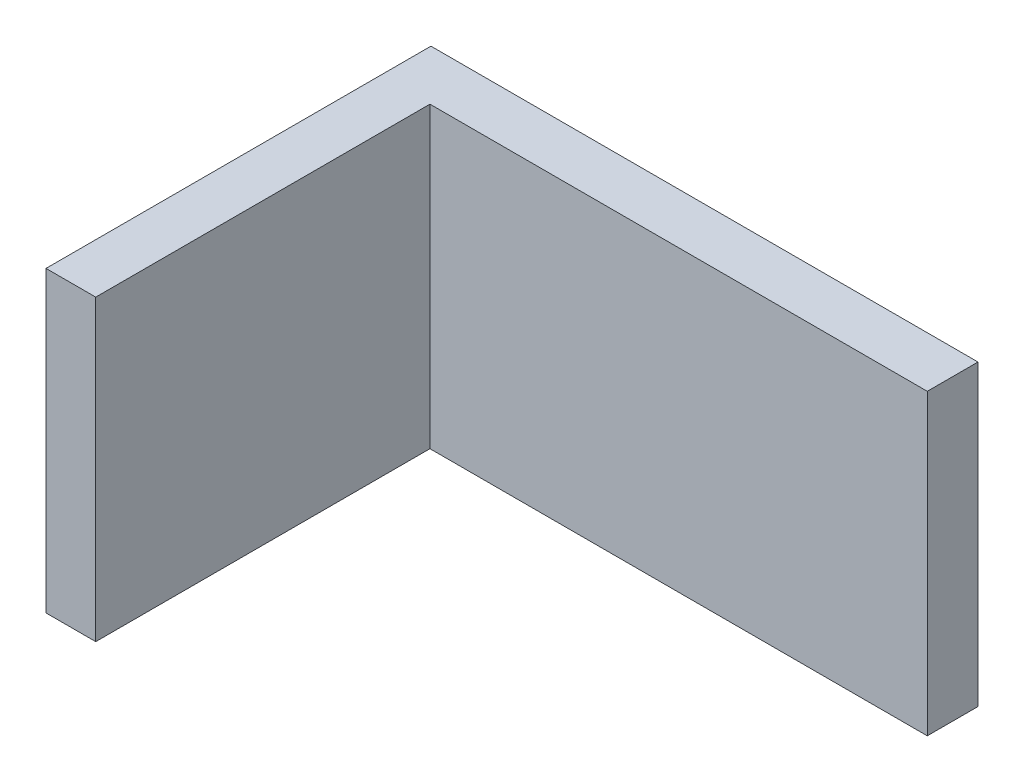
ISO-10303-21;
HEADER;
FILE_DESCRIPTION(('STEP AP214'),'2;1');
FILE_NAME('part.step','',(''),(''),'','','');
FILE_SCHEMA(('AUTOMOTIVE_DESIGN { 1 0 10303 214 1 1 1 1 }'));
ENDSEC;
DATA;
#1=APPLICATION_CONTEXT('core data for automotive mechanical design processes');
#2=APPLICATION_PROTOCOL_DEFINITION('international standard','automotive_design',2000,#1);
#3=PRODUCT_CONTEXT('',#1,'mechanical');
#4=PRODUCT('Part','Part','',(#3));
#5=PRODUCT_RELATED_PRODUCT_CATEGORY('part','',(#4));
#6=PRODUCT_DEFINITION_FORMATION('','',#4);
#7=PRODUCT_DEFINITION_CONTEXT('part definition',#1,'design');
#8=PRODUCT_DEFINITION('design','',#6,#7);
#9=PRODUCT_DEFINITION_SHAPE('','',#8);
#10=(LENGTH_UNIT() NAMED_UNIT(*) SI_UNIT(.MILLI.,.METRE.));
#11=(NAMED_UNIT(*) PLANE_ANGLE_UNIT() SI_UNIT($,.RADIAN.));
#12=(NAMED_UNIT(*) SI_UNIT($,.STERADIAN.) SOLID_ANGLE_UNIT());
#13=UNCERTAINTY_MEASURE_WITH_UNIT(LENGTH_MEASURE(1.E-05),#10,'distance_accuracy_value','');
#14=(GEOMETRIC_REPRESENTATION_CONTEXT(3) GLOBAL_UNCERTAINTY_ASSIGNED_CONTEXT((#13)) GLOBAL_UNIT_ASSIGNED_CONTEXT((#10,
#11,#12)) REPRESENTATION_CONTEXT('',''));
#15=CARTESIAN_POINT('',(0.,0.,0.));
#16=DIRECTION('',(0.,0.,1.));
#17=DIRECTION('',(1.,0.,0.));
#18=AXIS2_PLACEMENT_3D('',#15,#16,#17);
#19=CARTESIAN_POINT('',(-4.55,-0.4,0.));
#20=DIRECTION('',(0.,-1.,0.));
#21=DIRECTION('',(0.,0.,1.));
#22=AXIS2_PLACEMENT_3D('',#19,#20,#21);
#23=PLANE('',#22);
#24=DIRECTION('',(-1.,0.,0.));
#25=VECTOR('',#24,1.);
#26=CARTESIAN_POINT('',(-4.,-0.4,0.));
#27=LINE('',#26,#25);
#28=CARTESIAN_POINT('',(-4.,-0.4,0.));
#29=VERTEX_POINT('',#28);
#30=CARTESIAN_POINT('',(-4.55,-0.4,0.));
#31=VERTEX_POINT('',#30);
#32=EDGE_CURVE('E11',#29,#31,#27,.T.);
#33=ORIENTED_EDGE('',*,*,#32,.F.);
#34=DIRECTION('',(0.,0.,-1.));
#35=VECTOR('',#34,1.);
#36=CARTESIAN_POINT('',(-4.,-0.4,0.051));
#37=LINE('',#36,#35);
#38=CARTESIAN_POINT('',(-4.,-0.4,0.051));
#39=VERTEX_POINT('',#38);
#40=EDGE_CURVE('E24',#39,#29,#37,.T.);
#41=ORIENTED_EDGE('',*,*,#40,.F.);
#42=DIRECTION('',(1.,0.,0.));
#43=VECTOR('',#42,1.);
#44=CARTESIAN_POINT('',(-4.5,-0.4,0.051));
#45=LINE('',#44,#43);
#46=CARTESIAN_POINT('',(-4.5,-0.4,0.051));
#47=VERTEX_POINT('',#46);
#48=EDGE_CURVE('E87',#47,#39,#45,.T.);
#49=ORIENTED_EDGE('',*,*,#48,.F.);
#50=DIRECTION('',(0.,0.,-1.));
#51=VECTOR('',#50,1.);
#52=CARTESIAN_POINT('',(-4.5,-0.4,0.387));
#53=LINE('',#52,#51);
#54=CARTESIAN_POINT('',(-4.5,-0.4,0.387));
#55=VERTEX_POINT('',#54);
#56=EDGE_CURVE('E114',#55,#47,#53,.T.);
#57=ORIENTED_EDGE('',*,*,#56,.F.);
#58=DIRECTION('',(1.,0.,0.));
#59=VECTOR('',#58,1.);
#60=CARTESIAN_POINT('',(-4.55,-0.4,0.387));
#61=LINE('',#60,#59);
#62=CARTESIAN_POINT('',(-4.55,-0.4,0.387));
#63=VERTEX_POINT('',#62);
#64=EDGE_CURVE('E111',#63,#55,#61,.T.);
#65=ORIENTED_EDGE('',*,*,#64,.F.);
#66=DIRECTION('',(0.,0.,1.));
#67=VECTOR('',#66,1.);
#68=CARTESIAN_POINT('',(-4.55,-0.4,0.));
#69=LINE('',#68,#67);
#70=EDGE_CURVE('E108',#31,#63,#69,.T.);
#71=ORIENTED_EDGE('',*,*,#70,.F.);
#72=EDGE_LOOP('',(#33,#41,#49,#57,#65,#71));
#73=FACE_BOUND('',#72,.T.);
#74=ADVANCED_FACE('F17',(#73),#23,.T.);
#75=CARTESIAN_POINT('',(-4.,-0.1,0.));
#76=DIRECTION('',(0.,1.,0.));
#77=DIRECTION('',(0.,0.,1.));
#78=AXIS2_PLACEMENT_3D('',#75,#76,#77);
#79=PLANE('',#78);
#80=DIRECTION('',(1.,0.,0.));
#81=VECTOR('',#80,1.);
#82=CARTESIAN_POINT('',(-4.55,-0.1,0.));
#83=LINE('',#82,#81);
#84=CARTESIAN_POINT('',(-4.55,-0.1,0.));
#85=VERTEX_POINT('',#84);
#86=CARTESIAN_POINT('',(-4.,-0.1,0.));
#87=VERTEX_POINT('',#86);
#88=EDGE_CURVE('E106',#85,#87,#83,.T.);
#89=ORIENTED_EDGE('',*,*,#88,.F.);
#90=DIRECTION('',(0.,0.,-1.));
#91=VECTOR('',#90,1.);
#92=CARTESIAN_POINT('',(-4.55,-0.1,0.387));
#93=LINE('',#92,#91);
#94=CARTESIAN_POINT('',(-4.55,-0.1,0.387));
#95=VERTEX_POINT('',#94);
#96=EDGE_CURVE('E103',#95,#85,#93,.T.);
#97=ORIENTED_EDGE('',*,*,#96,.F.);
#98=DIRECTION('',(-1.,0.,0.));
#99=VECTOR('',#98,1.);
#100=CARTESIAN_POINT('',(-4.5,-0.1,0.387));
#101=LINE('',#100,#99);
#102=CARTESIAN_POINT('',(-4.5,-0.1,0.387));
#103=VERTEX_POINT('',#102);
#104=EDGE_CURVE('E100',#103,#95,#101,.T.);
#105=ORIENTED_EDGE('',*,*,#104,.F.);
#106=DIRECTION('',(0.,0.,1.));
#107=VECTOR('',#106,1.);
#108=CARTESIAN_POINT('',(-4.5,-0.1,0.051));
#109=LINE('',#108,#107);
#110=CARTESIAN_POINT('',(-4.5,-0.1,0.051));
#111=VERTEX_POINT('',#110);
#112=EDGE_CURVE('E72',#111,#103,#109,.T.);
#113=ORIENTED_EDGE('',*,*,#112,.F.);
#114=DIRECTION('',(-1.,0.,0.));
#115=VECTOR('',#114,1.);
#116=CARTESIAN_POINT('',(-4.,-0.1,0.051));
#117=LINE('',#116,#115);
#118=CARTESIAN_POINT('',(-4.,-0.1,0.051));
#119=VERTEX_POINT('',#118);
#120=EDGE_CURVE('E66',#119,#111,#117,.T.);
#121=ORIENTED_EDGE('',*,*,#120,.F.);
#122=DIRECTION('',(0.,0.,1.));
#123=VECTOR('',#122,1.);
#124=CARTESIAN_POINT('',(-4.,-0.1,0.));
#125=LINE('',#124,#123);
#126=EDGE_CURVE('E69',#87,#119,#125,.T.);
#127=ORIENTED_EDGE('',*,*,#126,.F.);
#128=EDGE_LOOP('',(#89,#97,#105,#113,#121,#127));
#129=FACE_BOUND('',#128,.T.);
#130=ADVANCED_FACE('F68',(#129),#79,.T.);
#131=CARTESIAN_POINT('',(-4.55,-0.4,0.387));
#132=DIRECTION('',(0.,0.,1.));
#133=DIRECTION('',(0.,1.,0.));
#134=AXIS2_PLACEMENT_3D('',#131,#132,#133);
#135=PLANE('',#134);
#136=ORIENTED_EDGE('',*,*,#64,.T.);
#137=DIRECTION('',(0.,-1.,0.));
#138=VECTOR('',#137,1.);
#139=CARTESIAN_POINT('',(-4.5,-0.1,0.387));
#140=LINE('',#139,#138);
#141=EDGE_CURVE('E83',#103,#55,#140,.T.);
#142=ORIENTED_EDGE('',*,*,#141,.F.);
#143=ORIENTED_EDGE('',*,*,#104,.T.);
#144=DIRECTION('',(0.,1.,0.));
#145=VECTOR('',#144,1.);
#146=CARTESIAN_POINT('',(-4.55,-0.4,0.387));
#147=LINE('',#146,#145);
#148=EDGE_CURVE('E88',#63,#95,#147,.T.);
#149=ORIENTED_EDGE('',*,*,#148,.F.);
#150=EDGE_LOOP('',(#136,#142,#143,#149));
#151=FACE_BOUND('',#150,.T.);
#152=ADVANCED_FACE('F125',(#151),#135,.T.);
#153=CARTESIAN_POINT('',(-4.5,-0.4,0.051));
#154=DIRECTION('',(0.,0.,1.));
#155=DIRECTION('',(0.,1.,0.));
#156=AXIS2_PLACEMENT_3D('',#153,#154,#155);
#157=PLANE('',#156);
#158=ORIENTED_EDGE('',*,*,#48,.T.);
#159=DIRECTION('',(0.,-1.,0.));
#160=VECTOR('',#159,1.);
#161=CARTESIAN_POINT('',(-4.,-0.1,0.051));
#162=LINE('',#161,#160);
#163=EDGE_CURVE('E81',#119,#39,#162,.T.);
#164=ORIENTED_EDGE('',*,*,#163,.F.);
#165=ORIENTED_EDGE('',*,*,#120,.T.);
#166=DIRECTION('',(0.,1.,0.));
#167=VECTOR('',#166,1.);
#168=CARTESIAN_POINT('',(-4.5,-0.4,0.051));
#169=LINE('',#168,#167);
#170=EDGE_CURVE('E89',#47,#111,#169,.T.);
#171=ORIENTED_EDGE('',*,*,#170,.F.);
#172=EDGE_LOOP('',(#158,#164,#165,#171));
#173=FACE_BOUND('',#172,.T.);
#174=ADVANCED_FACE('F86',(#173),#157,.T.);
#175=CARTESIAN_POINT('',(-4.55,-0.1,0.));
#176=DIRECTION('',(-1.,0.,0.));
#177=DIRECTION('',(0.,0.,1.));
#178=AXIS2_PLACEMENT_3D('',#175,#176,#177);
#179=PLANE('',#178);
#180=DIRECTION('',(0.,1.,0.));
#181=VECTOR('',#180,1.);
#182=CARTESIAN_POINT('',(-4.55,-0.4,0.));
#183=LINE('',#182,#181);
#184=EDGE_CURVE('E93',#31,#85,#183,.T.);
#185=ORIENTED_EDGE('',*,*,#184,.F.);
#186=ORIENTED_EDGE('',*,*,#70,.T.);
#187=ORIENTED_EDGE('',*,*,#148,.T.);
#188=ORIENTED_EDGE('',*,*,#96,.T.);
#189=EDGE_LOOP('',(#185,#186,#187,#188));
#190=FACE_BOUND('',#189,.T.);
#191=ADVANCED_FACE('F121',(#190),#179,.T.);
#192=CARTESIAN_POINT('',(-4.,-0.4,0.));
#193=DIRECTION('',(1.,0.,0.));
#194=DIRECTION('',(0.,0.,1.));
#195=AXIS2_PLACEMENT_3D('',#192,#193,#194);
#196=PLANE('',#195);
#197=DIRECTION('',(0.,-1.,0.));
#198=VECTOR('',#197,1.);
#199=CARTESIAN_POINT('',(-4.,-0.1,0.));
#200=LINE('',#199,#198);
#201=EDGE_CURVE('E82',#87,#29,#200,.T.);
#202=ORIENTED_EDGE('',*,*,#201,.F.);
#203=ORIENTED_EDGE('',*,*,#126,.T.);
#204=ORIENTED_EDGE('',*,*,#163,.T.);
#205=ORIENTED_EDGE('',*,*,#40,.T.);
#206=EDGE_LOOP('',(#202,#203,#204,#205));
#207=FACE_BOUND('',#206,.T.);
#208=ADVANCED_FACE('F80',(#207),#196,.T.);
#209=CARTESIAN_POINT('',(-4.5,-0.4,0.051));
#210=DIRECTION('',(1.,0.,0.));
#211=DIRECTION('',(0.,0.,1.));
#212=AXIS2_PLACEMENT_3D('',#209,#210,#211);
#213=PLANE('',#212);
#214=ORIENTED_EDGE('',*,*,#170,.T.);
#215=ORIENTED_EDGE('',*,*,#112,.T.);
#216=ORIENTED_EDGE('',*,*,#141,.T.);
#217=ORIENTED_EDGE('',*,*,#56,.T.);
#218=EDGE_LOOP('',(#214,#215,#216,#217));
#219=FACE_BOUND('',#218,.T.);
#220=ADVANCED_FACE('F127',(#219),#213,.T.);
#221=CARTESIAN_POINT('',(-4.55,-0.1,0.));
#222=DIRECTION('',(0.,0.,-1.));
#223=DIRECTION('',(0.,1.,0.));
#224=AXIS2_PLACEMENT_3D('',#221,#222,#223);
#225=PLANE('',#224);
#226=ORIENTED_EDGE('',*,*,#88,.T.);
#227=ORIENTED_EDGE('',*,*,#201,.T.);
#228=ORIENTED_EDGE('',*,*,#32,.T.);
#229=ORIENTED_EDGE('',*,*,#184,.T.);
#230=EDGE_LOOP('',(#226,#227,#228,#229));
#231=FACE_BOUND('',#230,.T.);
#232=ADVANCED_FACE('F117',(#231),#225,.T.);
#233=CLOSED_SHELL('',(#74,#130,#152,#174,#191,#208,#220,#232));
#234=MANIFOLD_SOLID_BREP('B1',#233);
#235=ADVANCED_BREP_SHAPE_REPRESENTATION('',(#18,#234),#14);
#236=SHAPE_DEFINITION_REPRESENTATION(#9,#235);
ENDSEC;
END-ISO-10303-21;
